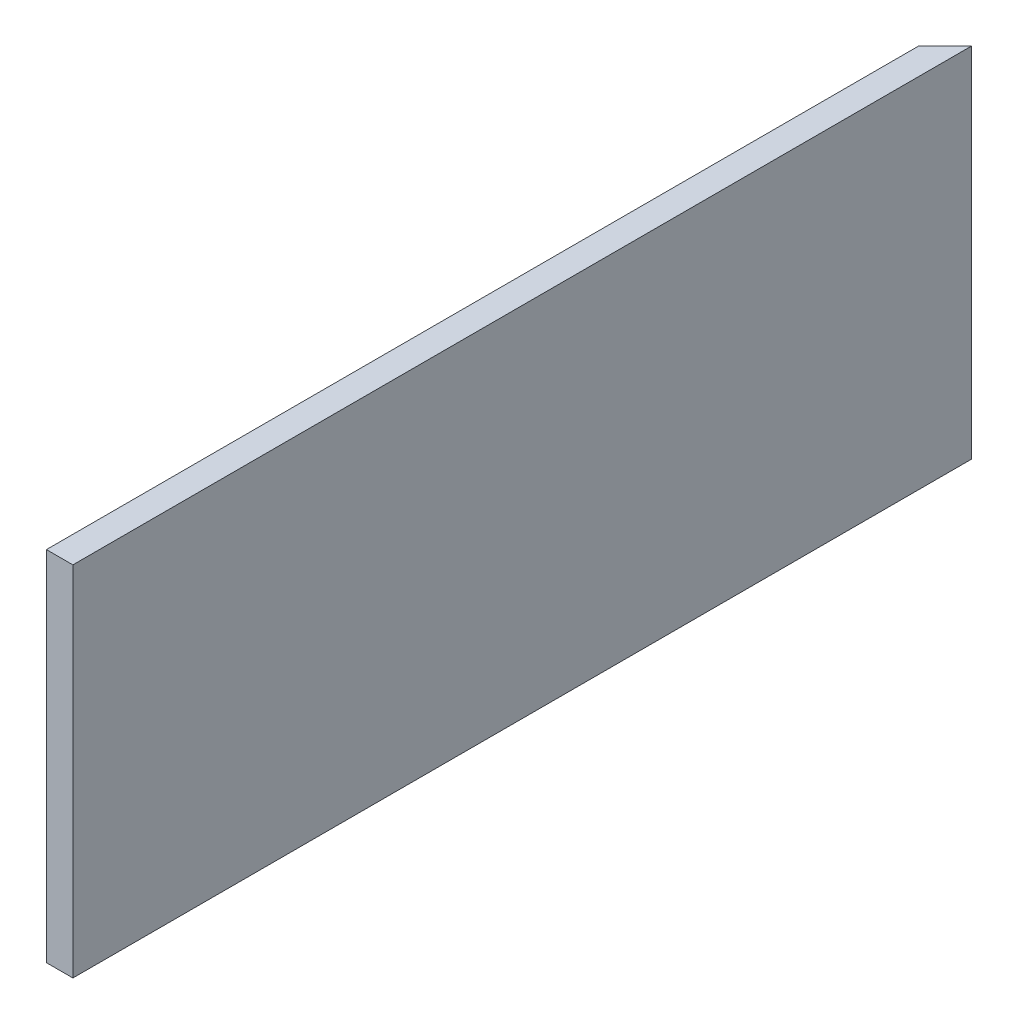
ISO-10303-21;
HEADER;
FILE_DESCRIPTION(('STEP AP214'),'2;1');
FILE_NAME('part.step','',(''),(''),'','','');
FILE_SCHEMA(('AUTOMOTIVE_DESIGN { 1 0 10303 214 1 1 1 1 }'));
ENDSEC;
DATA;
#1=APPLICATION_CONTEXT('core data for automotive mechanical design processes');
#2=APPLICATION_PROTOCOL_DEFINITION('international standard','automotive_design',2000,#1);
#3=PRODUCT_CONTEXT('',#1,'mechanical');
#4=PRODUCT('Part','Part','',(#3));
#5=PRODUCT_RELATED_PRODUCT_CATEGORY('part','',(#4));
#6=PRODUCT_DEFINITION_FORMATION('','',#4);
#7=PRODUCT_DEFINITION_CONTEXT('part definition',#1,'design');
#8=PRODUCT_DEFINITION('design','',#6,#7);
#9=PRODUCT_DEFINITION_SHAPE('','',#8);
#10=(LENGTH_UNIT() NAMED_UNIT(*) SI_UNIT(.MILLI.,.METRE.));
#11=(NAMED_UNIT(*) PLANE_ANGLE_UNIT() SI_UNIT($,.RADIAN.));
#12=(NAMED_UNIT(*) SI_UNIT($,.STERADIAN.) SOLID_ANGLE_UNIT());
#13=UNCERTAINTY_MEASURE_WITH_UNIT(LENGTH_MEASURE(1.E-05),#10,'distance_accuracy_value','');
#14=(GEOMETRIC_REPRESENTATION_CONTEXT(3) GLOBAL_UNCERTAINTY_ASSIGNED_CONTEXT((#13)) GLOBAL_UNIT_ASSIGNED_CONTEXT((#10,
#11,#12)) REPRESENTATION_CONTEXT('',''));
#15=CARTESIAN_POINT('',(0.,0.,0.));
#16=DIRECTION('',(0.,0.,1.));
#17=DIRECTION('',(1.,0.,0.));
#18=AXIS2_PLACEMENT_3D('',#15,#16,#17);
#19=CARTESIAN_POINT('',(418.642799999999,171.7294,-632.854613805219));
#20=DIRECTION('',(-1.,0.,0.));
#21=DIRECTION('',(0.,-1.,0.));
#22=AXIS2_PLACEMENT_3D('',#19,#20,#21);
#23=PLANE('',#22);
#24=DIRECTION('',(0.,1.,0.));
#25=VECTOR('',#24,1.);
#26=CARTESIAN_POINT('',(418.642799999999,171.729399999998,-418.642799999999));
#27=LINE('',#26,#25);
#28=CARTESIAN_POINT('',(418.6428,0.,-418.6428));
#29=VERTEX_POINT('',#28);
#30=CARTESIAN_POINT('',(418.642799999999,171.7294,-418.642799999999));
#31=VERTEX_POINT('',#30);
#32=EDGE_CURVE('E48',#29,#31,#27,.T.);
#33=ORIENTED_EDGE('',*,*,#32,.F.);
#34=DIRECTION('',(0.,0.,1.));
#35=VECTOR('',#34,1.);
#36=CARTESIAN_POINT('',(418.6428,0.,-632.854613805219));
#37=LINE('',#36,#35);
#38=CARTESIAN_POINT('',(418.6428,0.,0.));
#39=VERTEX_POINT('',#38);
#40=EDGE_CURVE('E76',#29,#39,#37,.T.);
#41=ORIENTED_EDGE('',*,*,#40,.T.);
#42=DIRECTION('',(0.,-1.,0.));
#43=VECTOR('',#42,1.);
#44=CARTESIAN_POINT('',(418.642799999999,171.7294,0.));
#45=LINE('',#44,#43);
#46=CARTESIAN_POINT('',(418.642799999999,171.7294,0.));
#47=VERTEX_POINT('',#46);
#48=EDGE_CURVE('E80',#47,#39,#45,.T.);
#49=ORIENTED_EDGE('',*,*,#48,.F.);
#50=DIRECTION('',(0.,0.,1.));
#51=VECTOR('',#50,1.);
#52=CARTESIAN_POINT('',(418.642799999999,171.7294,-632.854613805219));
#53=LINE('',#52,#51);
#54=EDGE_CURVE('E108',#31,#47,#53,.T.);
#55=ORIENTED_EDGE('',*,*,#54,.F.);
#56=EDGE_LOOP('',(#33,#41,#49,#55));
#57=FACE_BOUND('',#56,.T.);
#58=ADVANCED_FACE('F39',(#57),#23,.T.);
#59=CARTESIAN_POINT('',(431.342799999999,171.7294,-632.854613805219));
#60=DIRECTION('',(0.,1.,0.));
#61=DIRECTION('',(0.,0.,1.));
#62=AXIS2_PLACEMENT_3D('',#59,#60,#61);
#63=PLANE('',#62);
#64=DIRECTION('',(0.707106781186548,0.,-0.707106781186548));
#65=VECTOR('',#64,1.);
#66=CARTESIAN_POINT('',(532.098706902609,171.7294,-532.098706902609));
#67=LINE('',#66,#65);
#68=CARTESIAN_POINT('',(431.342799999999,171.7294,-431.342799999999));
#69=VERTEX_POINT('',#68);
#70=EDGE_CURVE('E54',#31,#69,#67,.T.);
#71=ORIENTED_EDGE('',*,*,#70,.F.);
#72=ORIENTED_EDGE('',*,*,#54,.T.);
#73=DIRECTION('',(-1.,0.,0.));
#74=VECTOR('',#73,1.);
#75=CARTESIAN_POINT('',(431.342799999999,171.7294,0.));
#76=LINE('',#75,#74);
#77=CARTESIAN_POINT('',(431.342799999999,171.7294,0.));
#78=VERTEX_POINT('',#77);
#79=EDGE_CURVE('E86',#78,#47,#76,.T.);
#80=ORIENTED_EDGE('',*,*,#79,.F.);
#81=DIRECTION('',(0.,0.,1.));
#82=VECTOR('',#81,1.);
#83=CARTESIAN_POINT('',(431.342799999999,171.7294,-632.854613805219));
#84=LINE('',#83,#82);
#85=EDGE_CURVE('E112',#69,#78,#84,.T.);
#86=ORIENTED_EDGE('',*,*,#85,.F.);
#87=EDGE_LOOP('',(#71,#72,#80,#86));
#88=FACE_BOUND('',#87,.T.);
#89=ADVANCED_FACE('F123',(#88),#63,.T.);
#90=CARTESIAN_POINT('',(431.3428,0.,-632.854613805219));
#91=DIRECTION('',(1.,0.,0.));
#92=DIRECTION('',(0.,1.,0.));
#93=AXIS2_PLACEMENT_3D('',#90,#91,#92);
#94=PLANE('',#93);
#95=DIRECTION('',(0.,-1.,0.));
#96=VECTOR('',#95,1.);
#97=CARTESIAN_POINT('',(431.3428,-1.49817977430545E-12,-431.3428));
#98=LINE('',#97,#96);
#99=CARTESIAN_POINT('',(431.3428,0.,-431.3428));
#100=VERTEX_POINT('',#99);
#101=EDGE_CURVE('E111',#69,#100,#98,.T.);
#102=ORIENTED_EDGE('',*,*,#101,.F.);
#103=ORIENTED_EDGE('',*,*,#85,.T.);
#104=DIRECTION('',(0.,1.,0.));
#105=VECTOR('',#104,1.);
#106=CARTESIAN_POINT('',(431.3428,0.,0.));
#107=LINE('',#106,#105);
#108=CARTESIAN_POINT('',(431.3428,0.,0.));
#109=VERTEX_POINT('',#108);
#110=EDGE_CURVE('E95',#109,#78,#107,.T.);
#111=ORIENTED_EDGE('',*,*,#110,.F.);
#112=DIRECTION('',(0.,0.,1.));
#113=VECTOR('',#112,1.);
#114=CARTESIAN_POINT('',(431.3428,0.,-632.854613805219));
#115=LINE('',#114,#113);
#116=EDGE_CURVE('E85',#100,#109,#115,.T.);
#117=ORIENTED_EDGE('',*,*,#116,.F.);
#118=EDGE_LOOP('',(#102,#103,#111,#117));
#119=FACE_BOUND('',#118,.T.);
#120=ADVANCED_FACE('F125',(#119),#94,.T.);
#121=CARTESIAN_POINT('',(418.6428,0.,-632.854613805219));
#122=DIRECTION('',(0.,-1.,0.));
#123=DIRECTION('',(0.,0.,-1.));
#124=AXIS2_PLACEMENT_3D('',#121,#122,#123);
#125=PLANE('',#124);
#126=DIRECTION('',(-0.707106781186548,0.,0.707106781186548));
#127=VECTOR('',#126,1.);
#128=CARTESIAN_POINT('',(525.748706902609,0.,-525.748706902609));
#129=LINE('',#128,#127);
#130=EDGE_CURVE('E11',#100,#29,#129,.T.);
#131=ORIENTED_EDGE('',*,*,#130,.F.);
#132=ORIENTED_EDGE('',*,*,#116,.T.);
#133=DIRECTION('',(1.,0.,0.));
#134=VECTOR('',#133,1.);
#135=CARTESIAN_POINT('',(418.6428,0.,0.));
#136=LINE('',#135,#134);
#137=EDGE_CURVE('E88',#39,#109,#136,.T.);
#138=ORIENTED_EDGE('',*,*,#137,.F.);
#139=ORIENTED_EDGE('',*,*,#40,.F.);
#140=EDGE_LOOP('',(#131,#132,#138,#139));
#141=FACE_BOUND('',#140,.T.);
#142=ADVANCED_FACE('F89',(#141),#125,.T.);
#143=CARTESIAN_POINT('',(0.,0.,0.));
#144=DIRECTION('',(0.,0.,1.));
#145=DIRECTION('',(1.,0.,0.));
#146=AXIS2_PLACEMENT_3D('',#143,#144,#145);
#147=PLANE('',#146);
#148=ORIENTED_EDGE('',*,*,#48,.T.);
#149=ORIENTED_EDGE('',*,*,#137,.T.);
#150=ORIENTED_EDGE('',*,*,#110,.T.);
#151=ORIENTED_EDGE('',*,*,#79,.T.);
#152=EDGE_LOOP('',(#148,#149,#150,#151));
#153=FACE_BOUND('',#152,.T.);
#154=ADVANCED_FACE('F97',(#153),#147,.T.);
#155=CARTESIAN_POINT('',(0.,0.,0.));
#156=DIRECTION('',(0.707106781186548,0.,0.707106781186548));
#157=DIRECTION('',(0.707106781186548,0.,-0.707106781186548));
#158=AXIS2_PLACEMENT_3D('',#155,#156,#157);
#159=PLANE('',#158);
#160=ORIENTED_EDGE('',*,*,#32,.T.);
#161=ORIENTED_EDGE('',*,*,#70,.T.);
#162=ORIENTED_EDGE('',*,*,#101,.T.);
#163=ORIENTED_EDGE('',*,*,#130,.T.);
#164=EDGE_LOOP('',(#160,#161,#162,#163));
#165=FACE_BOUND('',#164,.T.);
#166=ADVANCED_FACE('F120',(#165),#159,.F.);
#167=CLOSED_SHELL('',(#58,#89,#120,#142,#154,#166));
#168=MANIFOLD_SOLID_BREP('B2',#167);
#169=ADVANCED_BREP_SHAPE_REPRESENTATION('',(#18,#168),#14);
#170=SHAPE_DEFINITION_REPRESENTATION(#9,#169);
ENDSEC;
END-ISO-10303-21;
